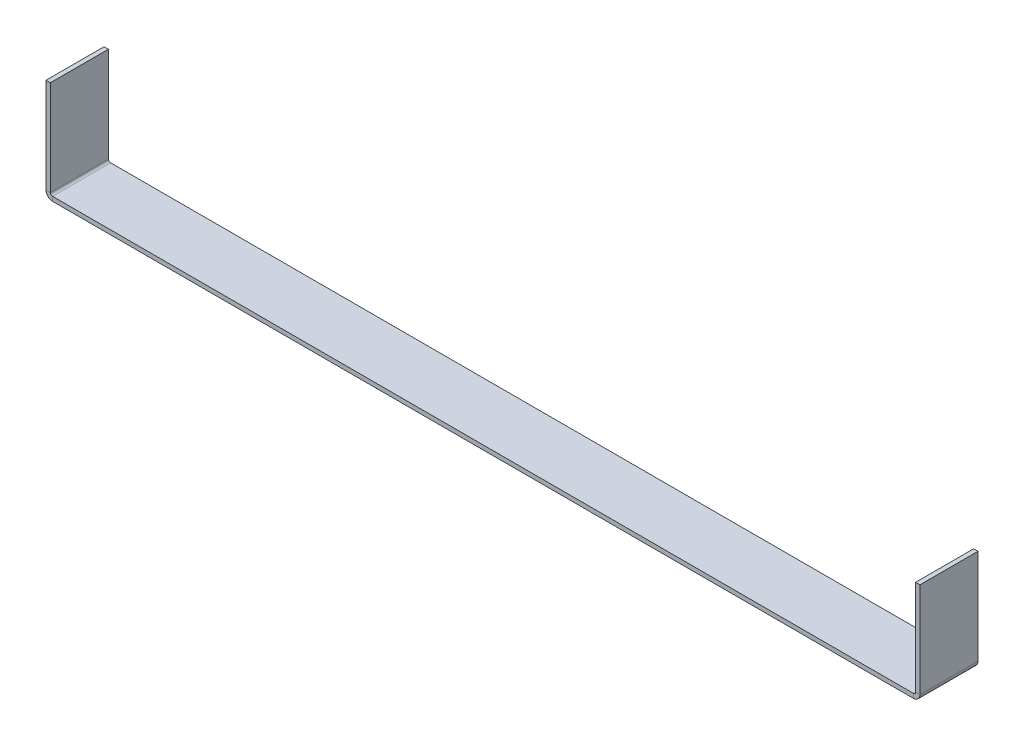
ISO-10303-21;
HEADER;
FILE_DESCRIPTION(('STEP AP214'),'2;1');
FILE_NAME('part.step','',(''),(''),'','','');
FILE_SCHEMA(('AUTOMOTIVE_DESIGN { 1 0 10303 214 1 1 1 1 }'));
ENDSEC;
DATA;
#1=APPLICATION_CONTEXT('core data for automotive mechanical design processes');
#2=APPLICATION_PROTOCOL_DEFINITION('international standard','automotive_design',2000,#1);
#3=PRODUCT_CONTEXT('',#1,'mechanical');
#4=PRODUCT('Part','Part','',(#3));
#5=PRODUCT_RELATED_PRODUCT_CATEGORY('part','',(#4));
#6=PRODUCT_DEFINITION_FORMATION('','',#4);
#7=PRODUCT_DEFINITION_CONTEXT('part definition',#1,'design');
#8=PRODUCT_DEFINITION('design','',#6,#7);
#9=PRODUCT_DEFINITION_SHAPE('','',#8);
#10=(LENGTH_UNIT() NAMED_UNIT(*) SI_UNIT(.MILLI.,.METRE.));
#11=(NAMED_UNIT(*) PLANE_ANGLE_UNIT() SI_UNIT($,.RADIAN.));
#12=(NAMED_UNIT(*) SI_UNIT($,.STERADIAN.) SOLID_ANGLE_UNIT());
#13=UNCERTAINTY_MEASURE_WITH_UNIT(LENGTH_MEASURE(1.E-05),#10,'distance_accuracy_value','');
#14=(GEOMETRIC_REPRESENTATION_CONTEXT(3) GLOBAL_UNCERTAINTY_ASSIGNED_CONTEXT((#13)) GLOBAL_UNIT_ASSIGNED_CONTEXT((#10,
#11,#12)) REPRESENTATION_CONTEXT('',''));
#15=CARTESIAN_POINT('',(0.,0.,0.));
#16=DIRECTION('',(0.,0.,1.));
#17=DIRECTION('',(1.,0.,0.));
#18=AXIS2_PLACEMENT_3D('',#15,#16,#17);
#19=CARTESIAN_POINT('',(0.,-1.5,0.));
#20=DIRECTION('',(0.,-1.,0.));
#21=DIRECTION('',(0.,0.,-1.));
#22=AXIS2_PLACEMENT_3D('',#19,#20,#21);
#23=PLANE('',#22);
#24=DIRECTION('',(-1.,0.,0.));
#25=VECTOR('',#24,1.);
#26=CARTESIAN_POINT('',(0.,-1.5,-20.));
#27=LINE('',#26,#25);
#28=CARTESIAN_POINT('',(298.7634,-1.5,-20.));
#29=VERTEX_POINT('',#28);
#30=CARTESIAN_POINT('',(2.2366,-1.5,-20.));
#31=VERTEX_POINT('',#30);
#32=EDGE_CURVE('E13',#29,#31,#27,.T.);
#33=ORIENTED_EDGE('',*,*,#32,.F.);
#34=DIRECTION('',(0.,0.,-1.));
#35=VECTOR('',#34,1.);
#36=CARTESIAN_POINT('',(298.7634,-1.5,-20.));
#37=LINE('',#36,#35);
#38=CARTESIAN_POINT('',(298.7634,-1.5,0.));
#39=VERTEX_POINT('',#38);
#40=EDGE_CURVE('E325',#29,#39,#37,.F.);
#41=ORIENTED_EDGE('',*,*,#40,.T.);
#42=DIRECTION('',(1.,0.,0.));
#43=VECTOR('',#42,1.);
#44=CARTESIAN_POINT('',(0.,-1.5,0.));
#45=LINE('',#44,#43);
#46=CARTESIAN_POINT('',(2.2366,-1.5,0.));
#47=VERTEX_POINT('',#46);
#48=EDGE_CURVE('E86',#47,#39,#45,.T.);
#49=ORIENTED_EDGE('',*,*,#48,.F.);
#50=DIRECTION('',(0.,0.,1.));
#51=VECTOR('',#50,1.);
#52=CARTESIAN_POINT('',(2.2366,-1.5,0.));
#53=LINE('',#52,#51);
#54=EDGE_CURVE('E100',#47,#31,#53,.F.);
#55=ORIENTED_EDGE('',*,*,#54,.T.);
#56=EDGE_LOOP('',(#33,#41,#49,#55));
#57=FACE_BOUND('',#56,.T.);
#58=ADVANCED_FACE('F77',(#57),#23,.T.);
#59=CARTESIAN_POINT('',(0.,0.,0.));
#60=DIRECTION('',(0.,-1.,0.));
#61=DIRECTION('',(0.,0.,-1.));
#62=AXIS2_PLACEMENT_3D('',#59,#60,#61);
#63=PLANE('',#62);
#64=DIRECTION('',(0.,0.,-1.));
#65=VECTOR('',#64,1.);
#66=CARTESIAN_POINT('',(298.7634,0.,-20.));
#67=LINE('',#66,#65);
#68=CARTESIAN_POINT('',(298.7634,0.,-20.));
#69=VERTEX_POINT('',#68);
#70=CARTESIAN_POINT('',(298.7634,0.,0.));
#71=VERTEX_POINT('',#70);
#72=EDGE_CURVE('E197',#69,#71,#67,.F.);
#73=ORIENTED_EDGE('',*,*,#72,.F.);
#74=DIRECTION('',(-1.,0.,0.));
#75=VECTOR('',#74,1.);
#76=CARTESIAN_POINT('',(0.,0.,-20.));
#77=LINE('',#76,#75);
#78=CARTESIAN_POINT('',(2.2366,0.,-20.));
#79=VERTEX_POINT('',#78);
#80=EDGE_CURVE('E81',#69,#79,#77,.T.);
#81=ORIENTED_EDGE('',*,*,#80,.T.);
#82=DIRECTION('',(0.,0.,1.));
#83=VECTOR('',#82,1.);
#84=CARTESIAN_POINT('',(2.2366,0.,0.));
#85=LINE('',#84,#83);
#86=CARTESIAN_POINT('',(2.2366,0.,0.));
#87=VERTEX_POINT('',#86);
#88=EDGE_CURVE('E144',#87,#79,#85,.F.);
#89=ORIENTED_EDGE('',*,*,#88,.F.);
#90=DIRECTION('',(1.,0.,0.));
#91=VECTOR('',#90,1.);
#92=CARTESIAN_POINT('',(0.,0.,0.));
#93=LINE('',#92,#91);
#94=EDGE_CURVE('E185',#87,#71,#93,.T.);
#95=ORIENTED_EDGE('',*,*,#94,.T.);
#96=EDGE_LOOP('',(#73,#81,#89,#95));
#97=FACE_BOUND('',#96,.T.);
#98=ADVANCED_FACE('F194',(#97),#63,.F.);
#99=CARTESIAN_POINT('',(0.,-1.5,-20.));
#100=DIRECTION('',(0.,0.,-1.));
#101=DIRECTION('',(-1.,0.,0.));
#102=AXIS2_PLACEMENT_3D('',#99,#100,#101);
#103=PLANE('',#102);
#104=ORIENTED_EDGE('',*,*,#80,.F.);
#105=DIRECTION('',(0.,-1.,0.));
#106=VECTOR('',#105,1.);
#107=CARTESIAN_POINT('',(298.7634,0.,-20.));
#108=LINE('',#107,#106);
#109=EDGE_CURVE('E331',#69,#29,#108,.T.);
#110=ORIENTED_EDGE('',*,*,#109,.T.);
#111=ORIENTED_EDGE('',*,*,#32,.T.);
#112=DIRECTION('',(0.,-1.,0.));
#113=VECTOR('',#112,1.);
#114=CARTESIAN_POINT('',(2.2366,0.,-20.));
#115=LINE('',#114,#113);
#116=EDGE_CURVE('E182',#79,#31,#115,.T.);
#117=ORIENTED_EDGE('',*,*,#116,.F.);
#118=EDGE_LOOP('',(#104,#110,#111,#117));
#119=FACE_BOUND('',#118,.T.);
#120=ADVANCED_FACE('F200',(#119),#103,.T.);
#121=CARTESIAN_POINT('',(0.,-1.5,0.));
#122=DIRECTION('',(0.,0.,1.));
#123=DIRECTION('',(1.,0.,0.));
#124=AXIS2_PLACEMENT_3D('',#121,#122,#123);
#125=PLANE('',#124);
#126=DIRECTION('',(0.,-1.,0.));
#127=VECTOR('',#126,1.);
#128=CARTESIAN_POINT('',(298.7634,0.,0.));
#129=LINE('',#128,#127);
#130=EDGE_CURVE('E173',#71,#39,#129,.T.);
#131=ORIENTED_EDGE('',*,*,#130,.F.);
#132=ORIENTED_EDGE('',*,*,#94,.F.);
#133=DIRECTION('',(0.,-1.,0.));
#134=VECTOR('',#133,1.);
#135=CARTESIAN_POINT('',(2.2366,0.,0.));
#136=LINE('',#135,#134);
#137=EDGE_CURVE('E143',#87,#47,#136,.T.);
#138=ORIENTED_EDGE('',*,*,#137,.T.);
#139=ORIENTED_EDGE('',*,*,#48,.T.);
#140=EDGE_LOOP('',(#131,#132,#138,#139));
#141=FACE_BOUND('',#140,.T.);
#142=ADVANCED_FACE('F79',(#141),#125,.T.);
#143=CARTESIAN_POINT('',(2.2366,0.7366,-20.));
#144=DIRECTION('',(0.,0.,-1.));
#145=DIRECTION('',(-1.,0.,0.));
#146=AXIS2_PLACEMENT_3D('',#143,#144,#145);
#147=PLANE('',#146);
#148=DIRECTION('',(1.,0.,0.));
#149=VECTOR('',#148,1.);
#150=CARTESIAN_POINT('',(0.,0.736599999999992,-20.));
#151=LINE('',#150,#149);
#152=CARTESIAN_POINT('',(1.5,0.736599999999997,-20.));
#153=VERTEX_POINT('',#152);
#154=CARTESIAN_POINT('',(0.,0.736599999999992,-20.));
#155=VERTEX_POINT('',#154);
#156=EDGE_CURVE('E134',#153,#155,#151,.F.);
#157=ORIENTED_EDGE('',*,*,#156,.F.);
#158=CARTESIAN_POINT('',(2.2366,0.7366,-20.));
#159=DIRECTION('',(0.,0.,1.));
#160=DIRECTION('',(1.,0.,0.));
#161=AXIS2_PLACEMENT_3D('',#158,#159,#160);
#162=CIRCLE('',#161,0.7366);
#163=EDGE_CURVE('E128',#79,#153,#162,.F.);
#164=ORIENTED_EDGE('',*,*,#163,.F.);
#165=ORIENTED_EDGE('',*,*,#116,.T.);
#166=CARTESIAN_POINT('',(2.2366,0.7366,-20.));
#167=DIRECTION('',(0.,0.,1.));
#168=DIRECTION('',(1.,0.,0.));
#169=AXIS2_PLACEMENT_3D('',#166,#167,#168);
#170=CIRCLE('',#169,2.2366);
#171=EDGE_CURVE('E175',#31,#155,#170,.F.);
#172=ORIENTED_EDGE('',*,*,#171,.T.);
#173=EDGE_LOOP('',(#157,#164,#165,#172));
#174=FACE_BOUND('',#173,.T.);
#175=ADVANCED_FACE('F199',(#174),#147,.T.);
#176=CARTESIAN_POINT('',(2.2366,0.7366,0.));
#177=DIRECTION('',(0.,0.,-1.));
#178=DIRECTION('',(-1.,0.,0.));
#179=AXIS2_PLACEMENT_3D('',#176,#177,#178);
#180=PLANE('',#179);
#181=CARTESIAN_POINT('',(2.2366,0.7366,0.));
#182=DIRECTION('',(0.,0.,1.));
#183=DIRECTION('',(1.,0.,0.));
#184=AXIS2_PLACEMENT_3D('',#181,#182,#183);
#185=CIRCLE('',#184,0.7366);
#186=CARTESIAN_POINT('',(1.5,0.736599999999997,0.));
#187=VERTEX_POINT('',#186);
#188=EDGE_CURVE('E125',#187,#87,#185,.T.);
#189=ORIENTED_EDGE('',*,*,#188,.F.);
#190=DIRECTION('',(1.,0.,0.));
#191=VECTOR('',#190,1.);
#192=CARTESIAN_POINT('',(1.5,0.736599999999997,0.));
#193=LINE('',#192,#191);
#194=CARTESIAN_POINT('',(0.,0.736599999999992,0.));
#195=VERTEX_POINT('',#194);
#196=EDGE_CURVE('E133',#187,#195,#193,.F.);
#197=ORIENTED_EDGE('',*,*,#196,.T.);
#198=CARTESIAN_POINT('',(2.2366,0.7366,0.));
#199=DIRECTION('',(0.,0.,1.));
#200=DIRECTION('',(1.,0.,0.));
#201=AXIS2_PLACEMENT_3D('',#198,#199,#200);
#202=CIRCLE('',#201,2.2366);
#203=EDGE_CURVE('E176',#195,#47,#202,.T.);
#204=ORIENTED_EDGE('',*,*,#203,.T.);
#205=ORIENTED_EDGE('',*,*,#137,.F.);
#206=EDGE_LOOP('',(#189,#197,#204,#205));
#207=FACE_BOUND('',#206,.T.);
#208=ADVANCED_FACE('F139',(#207),#180,.F.);
#209=CARTESIAN_POINT('',(2.2366,0.7366,0.));
#210=DIRECTION('',(0.,0.,1.));
#211=DIRECTION('',(-1.,0.,0.));
#212=AXIS2_PLACEMENT_3D('',#209,#210,#211);
#213=CYLINDRICAL_SURFACE('',#212,2.2366);
#214=ORIENTED_EDGE('',*,*,#54,.F.);
#215=ORIENTED_EDGE('',*,*,#203,.F.);
#216=DIRECTION('',(0.,0.,1.));
#217=VECTOR('',#216,1.);
#218=CARTESIAN_POINT('',(0.,0.736599999999992,-20.));
#219=LINE('',#218,#217);
#220=EDGE_CURVE('E157',#195,#155,#219,.F.);
#221=ORIENTED_EDGE('',*,*,#220,.T.);
#222=ORIENTED_EDGE('',*,*,#171,.F.);
#223=EDGE_LOOP('',(#214,#215,#221,#222));
#224=FACE_BOUND('',#223,.T.);
#225=ADVANCED_FACE('F216',(#224),#213,.T.);
#226=CARTESIAN_POINT('',(2.2366,0.7366,0.));
#227=DIRECTION('',(0.,0.,1.));
#228=DIRECTION('',(-1.,0.,0.));
#229=AXIS2_PLACEMENT_3D('',#226,#227,#228);
#230=CYLINDRICAL_SURFACE('',#229,0.7366);
#231=ORIENTED_EDGE('',*,*,#88,.T.);
#232=ORIENTED_EDGE('',*,*,#163,.T.);
#233=DIRECTION('',(0.,0.,1.));
#234=VECTOR('',#233,1.);
#235=CARTESIAN_POINT('',(1.5,0.736599999999997,-20.));
#236=LINE('',#235,#234);
#237=EDGE_CURVE('E121',#153,#187,#236,.T.);
#238=ORIENTED_EDGE('',*,*,#237,.T.);
#239=ORIENTED_EDGE('',*,*,#188,.T.);
#240=EDGE_LOOP('',(#231,#232,#238,#239));
#241=FACE_BOUND('',#240,.T.);
#242=ADVANCED_FACE('F124',(#241),#230,.F.);
#243=CARTESIAN_POINT('',(0.,0.,-20.));
#244=DIRECTION('',(0.,0.,1.));
#245=DIRECTION('',(1.,0.,0.));
#246=AXIS2_PLACEMENT_3D('',#243,#244,#245);
#247=PLANE('',#246);
#248=ORIENTED_EDGE('',*,*,#156,.T.);
#249=DIRECTION('',(0.,-1.,0.));
#250=VECTOR('',#249,1.);
#251=CARTESIAN_POINT('',(0.,0.,-20.));
#252=LINE('',#251,#250);
#253=CARTESIAN_POINT('',(-1.16964624851245E-13,33.5,-20.));
#254=VERTEX_POINT('',#253);
#255=EDGE_CURVE('E165',#254,#155,#252,.T.);
#256=ORIENTED_EDGE('',*,*,#255,.F.);
#257=DIRECTION('',(1.,0.,0.));
#258=VECTOR('',#257,1.);
#259=CARTESIAN_POINT('',(-1.16964624851245E-13,33.5,-20.));
#260=LINE('',#259,#258);
#261=CARTESIAN_POINT('',(1.49999999999988,33.5,-20.));
#262=VERTEX_POINT('',#261);
#263=EDGE_CURVE('E345',#254,#262,#260,.T.);
#264=ORIENTED_EDGE('',*,*,#263,.T.);
#265=DIRECTION('',(0.,1.,0.));
#266=VECTOR('',#265,1.);
#267=CARTESIAN_POINT('',(1.5,0.,-20.));
#268=LINE('',#267,#266);
#269=EDGE_CURVE('E163',#262,#153,#268,.F.);
#270=ORIENTED_EDGE('',*,*,#269,.T.);
#271=EDGE_LOOP('',(#248,#256,#264,#270));
#272=FACE_BOUND('',#271,.T.);
#273=ADVANCED_FACE('F221',(#272),#247,.F.);
#274=CARTESIAN_POINT('',(-1.16876994193937E-13,33.5,0.));
#275=DIRECTION('',(0.,0.,-1.));
#276=DIRECTION('',(-1.,0.,0.));
#277=AXIS2_PLACEMENT_3D('',#274,#275,#276);
#278=PLANE('',#277);
#279=ORIENTED_EDGE('',*,*,#196,.F.);
#280=DIRECTION('',(0.,-1.,0.));
#281=VECTOR('',#280,1.);
#282=CARTESIAN_POINT('',(1.49999999999988,33.5,0.));
#283=LINE('',#282,#281);
#284=CARTESIAN_POINT('',(1.49999999999988,33.5,0.));
#285=VERTEX_POINT('',#284);
#286=EDGE_CURVE('E153',#187,#285,#283,.F.);
#287=ORIENTED_EDGE('',*,*,#286,.T.);
#288=DIRECTION('',(1.,0.,0.));
#289=VECTOR('',#288,1.);
#290=CARTESIAN_POINT('',(-1.16876994193937E-13,33.5,0.));
#291=LINE('',#290,#289);
#292=CARTESIAN_POINT('',(-1.16964624851245E-13,33.5,0.));
#293=VERTEX_POINT('',#292);
#294=EDGE_CURVE('E145',#293,#285,#291,.T.);
#295=ORIENTED_EDGE('',*,*,#294,.F.);
#296=DIRECTION('',(0.,1.,0.));
#297=VECTOR('',#296,1.);
#298=CARTESIAN_POINT('',(0.,0.,0.));
#299=LINE('',#298,#297);
#300=EDGE_CURVE('E156',#195,#293,#299,.T.);
#301=ORIENTED_EDGE('',*,*,#300,.F.);
#302=EDGE_LOOP('',(#279,#287,#295,#301));
#303=FACE_BOUND('',#302,.T.);
#304=ADVANCED_FACE('F150',(#303),#278,.F.);
#305=CARTESIAN_POINT('',(0.,0.,0.));
#306=DIRECTION('',(1.,0.,0.));
#307=DIRECTION('',(0.,1.,0.));
#308=AXIS2_PLACEMENT_3D('',#305,#306,#307);
#309=PLANE('',#308);
#310=ORIENTED_EDGE('',*,*,#220,.F.);
#311=ORIENTED_EDGE('',*,*,#300,.T.);
#312=DIRECTION('',(0.,0.,-1.));
#313=VECTOR('',#312,1.);
#314=CARTESIAN_POINT('',(-1.16964624851245E-13,33.5,0.));
#315=LINE('',#314,#313);
#316=EDGE_CURVE('E348',#293,#254,#315,.T.);
#317=ORIENTED_EDGE('',*,*,#316,.T.);
#318=ORIENTED_EDGE('',*,*,#255,.T.);
#319=EDGE_LOOP('',(#310,#311,#317,#318));
#320=FACE_BOUND('',#319,.T.);
#321=ADVANCED_FACE('F229',(#320),#309,.F.);
#322=CARTESIAN_POINT('',(1.5,0.,0.));
#323=DIRECTION('',(1.,0.,0.));
#324=DIRECTION('',(0.,1.,0.));
#325=AXIS2_PLACEMENT_3D('',#322,#323,#324);
#326=PLANE('',#325);
#327=ORIENTED_EDGE('',*,*,#286,.F.);
#328=ORIENTED_EDGE('',*,*,#237,.F.);
#329=ORIENTED_EDGE('',*,*,#269,.F.);
#330=DIRECTION('',(0.,0.,1.));
#331=VECTOR('',#330,1.);
#332=CARTESIAN_POINT('',(1.49999999999988,33.5,-20.));
#333=LINE('',#332,#331);
#334=EDGE_CURVE('E162',#285,#262,#333,.F.);
#335=ORIENTED_EDGE('',*,*,#334,.F.);
#336=EDGE_LOOP('',(#327,#328,#329,#335));
#337=FACE_BOUND('',#336,.T.);
#338=ADVANCED_FACE('F160',(#337),#326,.T.);
#339=CARTESIAN_POINT('',(-1.16876994193937E-13,33.5,-20.));
#340=DIRECTION('',(0.,-1.,0.));
#341=DIRECTION('',(1.,0.,0.));
#342=AXIS2_PLACEMENT_3D('',#339,#340,#341);
#343=PLANE('',#342);
#344=ORIENTED_EDGE('',*,*,#334,.T.);
#345=ORIENTED_EDGE('',*,*,#263,.F.);
#346=ORIENTED_EDGE('',*,*,#316,.F.);
#347=ORIENTED_EDGE('',*,*,#294,.T.);
#348=EDGE_LOOP('',(#344,#345,#346,#347));
#349=FACE_BOUND('',#348,.T.);
#350=ADVANCED_FACE('F230',(#349),#343,.F.);
#351=CARTESIAN_POINT('',(298.7634,0.736599999999979,0.));
#352=DIRECTION('',(0.,0.,1.));
#353=DIRECTION('',(1.,0.,0.));
#354=AXIS2_PLACEMENT_3D('',#351,#352,#353);
#355=PLANE('',#354);
#356=DIRECTION('',(-1.,0.,0.));
#357=VECTOR('',#356,1.);
#358=CARTESIAN_POINT('',(301.,0.736599999999971,0.));
#359=LINE('',#358,#357);
#360=CARTESIAN_POINT('',(299.5,0.736599999999976,0.));
#361=VERTEX_POINT('',#360);
#362=CARTESIAN_POINT('',(301.,0.736599999999971,0.));
#363=VERTEX_POINT('',#362);
#364=EDGE_CURVE('E322',#361,#363,#359,.F.);
#365=ORIENTED_EDGE('',*,*,#364,.F.);
#366=CARTESIAN_POINT('',(298.7634,0.736599999999979,0.));
#367=DIRECTION('',(0.,0.,-1.));
#368=DIRECTION('',(-1.,0.,0.));
#369=AXIS2_PLACEMENT_3D('',#366,#367,#368);
#370=CIRCLE('',#369,0.736599999999976);
#371=EDGE_CURVE('E334',#71,#361,#370,.F.);
#372=ORIENTED_EDGE('',*,*,#371,.F.);
#373=ORIENTED_EDGE('',*,*,#130,.T.);
#374=CARTESIAN_POINT('',(298.7634,0.736599999999979,0.));
#375=DIRECTION('',(0.,0.,-1.));
#376=DIRECTION('',(-1.,0.,0.));
#377=AXIS2_PLACEMENT_3D('',#374,#375,#376);
#378=CIRCLE('',#377,2.23659999999998);
#379=EDGE_CURVE('E328',#39,#363,#378,.F.);
#380=ORIENTED_EDGE('',*,*,#379,.T.);
#381=EDGE_LOOP('',(#365,#372,#373,#380));
#382=FACE_BOUND('',#381,.T.);
#383=ADVANCED_FACE('F233',(#382),#355,.T.);
#384=CARTESIAN_POINT('',(298.7634,0.736599999999979,-20.));
#385=DIRECTION('',(0.,0.,1.));
#386=DIRECTION('',(1.,0.,0.));
#387=AXIS2_PLACEMENT_3D('',#384,#385,#386);
#388=PLANE('',#387);
#389=CARTESIAN_POINT('',(298.7634,0.736599999999979,-20.));
#390=DIRECTION('',(0.,0.,-1.));
#391=DIRECTION('',(-1.,0.,0.));
#392=AXIS2_PLACEMENT_3D('',#389,#390,#391);
#393=CIRCLE('',#392,0.736599999999976);
#394=CARTESIAN_POINT('',(299.5,0.736599999999976,-20.));
#395=VERTEX_POINT('',#394);
#396=EDGE_CURVE('E338',#395,#69,#393,.T.);
#397=ORIENTED_EDGE('',*,*,#396,.F.);
#398=DIRECTION('',(-1.,0.,0.));
#399=VECTOR('',#398,1.);
#400=CARTESIAN_POINT('',(299.5,0.736599999999976,-20.));
#401=LINE('',#400,#399);
#402=CARTESIAN_POINT('',(301.,0.736599999999971,-20.));
#403=VERTEX_POINT('',#402);
#404=EDGE_CURVE('E296',#395,#403,#401,.F.);
#405=ORIENTED_EDGE('',*,*,#404,.T.);
#406=CARTESIAN_POINT('',(298.7634,0.736599999999979,-20.));
#407=DIRECTION('',(0.,0.,-1.));
#408=DIRECTION('',(-1.,0.,0.));
#409=AXIS2_PLACEMENT_3D('',#406,#407,#408);
#410=CIRCLE('',#409,2.23659999999998);
#411=EDGE_CURVE('E329',#403,#29,#410,.T.);
#412=ORIENTED_EDGE('',*,*,#411,.T.);
#413=ORIENTED_EDGE('',*,*,#109,.F.);
#414=EDGE_LOOP('',(#397,#405,#412,#413));
#415=FACE_BOUND('',#414,.T.);
#416=ADVANCED_FACE('F240',(#415),#388,.F.);
#417=CARTESIAN_POINT('',(298.7634,0.736599999999979,-20.));
#418=DIRECTION('',(0.,0.,-1.));
#419=DIRECTION('',(1.,0.,0.));
#420=AXIS2_PLACEMENT_3D('',#417,#418,#419);
#421=CYLINDRICAL_SURFACE('',#420,2.23659999999998);
#422=ORIENTED_EDGE('',*,*,#40,.F.);
#423=ORIENTED_EDGE('',*,*,#411,.F.);
#424=DIRECTION('',(0.,0.,-1.));
#425=VECTOR('',#424,1.);
#426=CARTESIAN_POINT('',(301.,0.736599999999971,0.));
#427=LINE('',#426,#425);
#428=EDGE_CURVE('E281',#403,#363,#427,.F.);
#429=ORIENTED_EDGE('',*,*,#428,.T.);
#430=ORIENTED_EDGE('',*,*,#379,.F.);
#431=EDGE_LOOP('',(#422,#423,#429,#430));
#432=FACE_BOUND('',#431,.T.);
#433=ADVANCED_FACE('F243',(#432),#421,.T.);
#434=CARTESIAN_POINT('',(298.7634,0.736599999999979,-20.));
#435=DIRECTION('',(0.,0.,-1.));
#436=DIRECTION('',(1.,0.,0.));
#437=AXIS2_PLACEMENT_3D('',#434,#435,#436);
#438=CYLINDRICAL_SURFACE('',#437,0.736599999999976);
#439=ORIENTED_EDGE('',*,*,#72,.T.);
#440=ORIENTED_EDGE('',*,*,#371,.T.);
#441=DIRECTION('',(0.,0.,-1.));
#442=VECTOR('',#441,1.);
#443=CARTESIAN_POINT('',(299.5,0.736599999999976,0.));
#444=LINE('',#443,#442);
#445=EDGE_CURVE('E319',#361,#395,#444,.T.);
#446=ORIENTED_EDGE('',*,*,#445,.T.);
#447=ORIENTED_EDGE('',*,*,#396,.T.);
#448=EDGE_LOOP('',(#439,#440,#446,#447));
#449=FACE_BOUND('',#448,.T.);
#450=ADVANCED_FACE('F248',(#449),#438,.F.);
#451=CARTESIAN_POINT('',(301.,33.5,-20.));
#452=DIRECTION('',(0.,0.,1.));
#453=DIRECTION('',(1.,0.,0.));
#454=AXIS2_PLACEMENT_3D('',#451,#452,#453);
#455=PLANE('',#454);
#456=ORIENTED_EDGE('',*,*,#404,.F.);
#457=DIRECTION('',(0.,-1.,0.));
#458=VECTOR('',#457,1.);
#459=CARTESIAN_POINT('',(299.5,33.5,-20.));
#460=LINE('',#459,#458);
#461=CARTESIAN_POINT('',(299.5,33.5,-20.));
#462=VERTEX_POINT('',#461);
#463=EDGE_CURVE('E295',#395,#462,#460,.F.);
#464=ORIENTED_EDGE('',*,*,#463,.T.);
#465=DIRECTION('',(-1.,0.,0.));
#466=VECTOR('',#465,1.);
#467=CARTESIAN_POINT('',(301.,33.5,-20.));
#468=LINE('',#467,#466);
#469=CARTESIAN_POINT('',(301.,33.5,-20.));
#470=VERTEX_POINT('',#469);
#471=EDGE_CURVE('E304',#470,#462,#468,.T.);
#472=ORIENTED_EDGE('',*,*,#471,.F.);
#473=DIRECTION('',(0.,1.,0.));
#474=VECTOR('',#473,1.);
#475=CARTESIAN_POINT('',(301.,-1.00278089488042E-12,-20.));
#476=LINE('',#475,#474);
#477=EDGE_CURVE('E285',#403,#470,#476,.T.);
#478=ORIENTED_EDGE('',*,*,#477,.F.);
#479=EDGE_LOOP('',(#456,#464,#472,#478));
#480=FACE_BOUND('',#479,.T.);
#481=ADVANCED_FACE('F251',(#480),#455,.F.);
#482=CARTESIAN_POINT('',(301.,0.,0.));
#483=DIRECTION('',(0.,0.,-1.));
#484=DIRECTION('',(-1.,0.,0.));
#485=AXIS2_PLACEMENT_3D('',#482,#483,#484);
#486=PLANE('',#485);
#487=ORIENTED_EDGE('',*,*,#364,.T.);
#488=DIRECTION('',(0.,-1.,0.));
#489=VECTOR('',#488,1.);
#490=CARTESIAN_POINT('',(301.,-1.00278089488042E-12,0.));
#491=LINE('',#490,#489);
#492=CARTESIAN_POINT('',(301.,33.5,0.));
#493=VERTEX_POINT('',#492);
#494=EDGE_CURVE('E289',#493,#363,#491,.T.);
#495=ORIENTED_EDGE('',*,*,#494,.F.);
#496=DIRECTION('',(-1.,0.,0.));
#497=VECTOR('',#496,1.);
#498=CARTESIAN_POINT('',(301.,33.5,0.));
#499=LINE('',#498,#497);
#500=CARTESIAN_POINT('',(299.5,33.5,0.));
#501=VERTEX_POINT('',#500);
#502=EDGE_CURVE('E384',#493,#501,#499,.T.);
#503=ORIENTED_EDGE('',*,*,#502,.T.);
#504=DIRECTION('',(0.,1.,0.));
#505=VECTOR('',#504,1.);
#506=CARTESIAN_POINT('',(299.5,0.,0.));
#507=LINE('',#506,#505);
#508=EDGE_CURVE('E307',#501,#361,#507,.F.);
#509=ORIENTED_EDGE('',*,*,#508,.T.);
#510=EDGE_LOOP('',(#487,#495,#503,#509));
#511=FACE_BOUND('',#510,.T.);
#512=ADVANCED_FACE('F258',(#511),#486,.F.);
#513=CARTESIAN_POINT('',(301.,-1.00278089488042E-12,0.));
#514=DIRECTION('',(-1.,0.,0.));
#515=DIRECTION('',(0.,-1.,0.));
#516=AXIS2_PLACEMENT_3D('',#513,#514,#515);
#517=PLANE('',#516);
#518=ORIENTED_EDGE('',*,*,#428,.F.);
#519=ORIENTED_EDGE('',*,*,#477,.T.);
#520=DIRECTION('',(0.,0.,1.));
#521=VECTOR('',#520,1.);
#522=CARTESIAN_POINT('',(301.,33.5,0.));
#523=LINE('',#522,#521);
#524=EDGE_CURVE('E306',#470,#493,#523,.T.);
#525=ORIENTED_EDGE('',*,*,#524,.T.);
#526=ORIENTED_EDGE('',*,*,#494,.T.);
#527=EDGE_LOOP('',(#518,#519,#525,#526));
#528=FACE_BOUND('',#527,.T.);
#529=ADVANCED_FACE('F267',(#528),#517,.F.);
#530=CARTESIAN_POINT('',(299.5,-9.97543672872155E-13,0.));
#531=DIRECTION('',(-1.,0.,0.));
#532=DIRECTION('',(0.,-1.,0.));
#533=AXIS2_PLACEMENT_3D('',#530,#531,#532);
#534=PLANE('',#533);
#535=ORIENTED_EDGE('',*,*,#463,.F.);
#536=ORIENTED_EDGE('',*,*,#445,.F.);
#537=ORIENTED_EDGE('',*,*,#508,.F.);
#538=DIRECTION('',(0.,0.,-1.));
#539=VECTOR('',#538,1.);
#540=CARTESIAN_POINT('',(299.5,33.5,0.));
#541=LINE('',#540,#539);
#542=EDGE_CURVE('E311',#462,#501,#541,.F.);
#543=ORIENTED_EDGE('',*,*,#542,.F.);
#544=EDGE_LOOP('',(#535,#536,#537,#543));
#545=FACE_BOUND('',#544,.T.);
#546=ADVANCED_FACE('F263',(#545),#534,.T.);
#547=CARTESIAN_POINT('',(301.,33.5,0.));
#548=DIRECTION('',(0.,-1.,0.));
#549=DIRECTION('',(1.,0.,0.));
#550=AXIS2_PLACEMENT_3D('',#547,#548,#549);
#551=PLANE('',#550);
#552=ORIENTED_EDGE('',*,*,#542,.T.);
#553=ORIENTED_EDGE('',*,*,#502,.F.);
#554=ORIENTED_EDGE('',*,*,#524,.F.);
#555=ORIENTED_EDGE('',*,*,#471,.T.);
#556=EDGE_LOOP('',(#552,#553,#554,#555));
#557=FACE_BOUND('',#556,.T.);
#558=ADVANCED_FACE('F260',(#557),#551,.F.);
#559=CLOSED_SHELL('',(#58,#98,#120,#142,#175,#208,#225,#242,#273,#304,#321,#338,#350,#383,#416,
#433,#450,#481,#512,#529,#546,#558));
#560=MANIFOLD_SOLID_BREP('B2',#559);
#561=ADVANCED_BREP_SHAPE_REPRESENTATION('',(#18,#560),#14);
#562=SHAPE_DEFINITION_REPRESENTATION(#9,#561);
ENDSEC;
END-ISO-10303-21;
